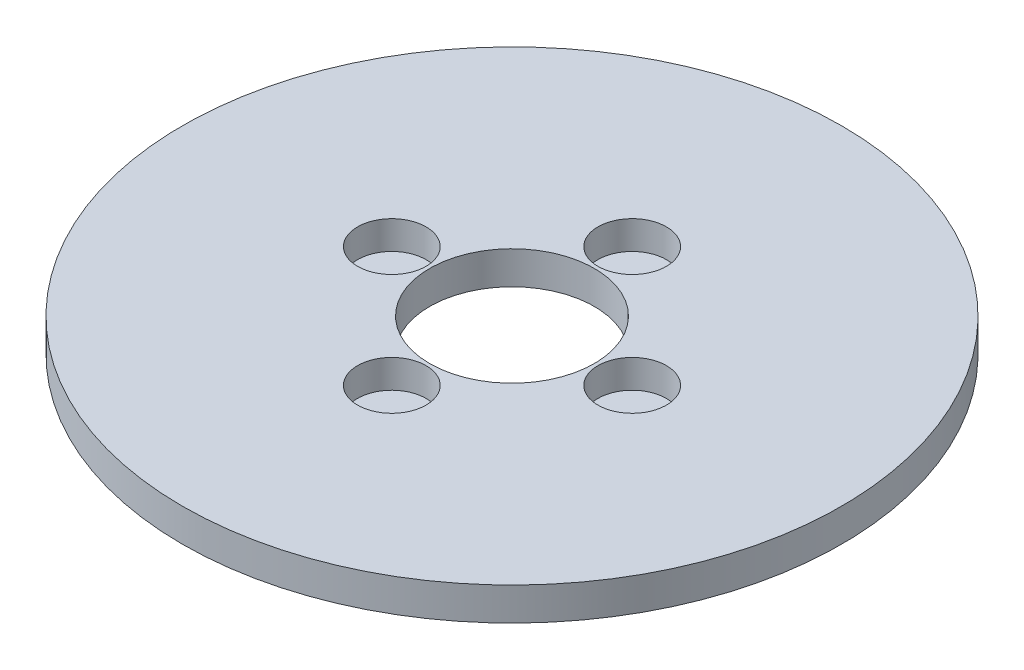
ISO-10303-21;
HEADER;
FILE_DESCRIPTION(('STEP AP214'),'2;1');
FILE_NAME('part.step','',(''),(''),'','','');
FILE_SCHEMA(('AUTOMOTIVE_DESIGN { 1 0 10303 214 1 1 1 1 }'));
ENDSEC;
DATA;
#1=APPLICATION_CONTEXT('core data for automotive mechanical design processes');
#2=APPLICATION_PROTOCOL_DEFINITION('international standard','automotive_design',2000,#1);
#3=PRODUCT_CONTEXT('',#1,'mechanical');
#4=PRODUCT('Part','Part','',(#3));
#5=PRODUCT_RELATED_PRODUCT_CATEGORY('part','',(#4));
#6=PRODUCT_DEFINITION_FORMATION('','',#4);
#7=PRODUCT_DEFINITION_CONTEXT('part definition',#1,'design');
#8=PRODUCT_DEFINITION('design','',#6,#7);
#9=PRODUCT_DEFINITION_SHAPE('','',#8);
#10=(LENGTH_UNIT() NAMED_UNIT(*) SI_UNIT(.MILLI.,.METRE.));
#11=(NAMED_UNIT(*) PLANE_ANGLE_UNIT() SI_UNIT($,.RADIAN.));
#12=(NAMED_UNIT(*) SI_UNIT($,.STERADIAN.) SOLID_ANGLE_UNIT());
#13=UNCERTAINTY_MEASURE_WITH_UNIT(LENGTH_MEASURE(1.E-05),#10,'distance_accuracy_value','');
#14=(GEOMETRIC_REPRESENTATION_CONTEXT(3) GLOBAL_UNCERTAINTY_ASSIGNED_CONTEXT((#13)) GLOBAL_UNIT_ASSIGNED_CONTEXT((#10,
#11,#12)) REPRESENTATION_CONTEXT('',''));
#15=CARTESIAN_POINT('',(0.,0.,0.));
#16=DIRECTION('',(0.,0.,1.));
#17=DIRECTION('',(1.,0.,0.));
#18=AXIS2_PLACEMENT_3D('',#15,#16,#17);
#19=CARTESIAN_POINT('',(0.,4.,0.));
#20=DIRECTION('',(0.,-1.,0.));
#21=DIRECTION('',(0.,0.,-1.));
#22=AXIS2_PLACEMENT_3D('',#19,#20,#21);
#23=CYLINDRICAL_SURFACE('',#22,40.);
#24=CARTESIAN_POINT('',(0.,4.,0.));
#25=DIRECTION('',(0.,1.,0.));
#26=DIRECTION('',(0.,0.,1.));
#27=AXIS2_PLACEMENT_3D('',#24,#25,#26);
#28=CIRCLE('',#27,40.);
#29=CARTESIAN_POINT('',(0.,4.,40.));
#30=VERTEX_POINT('',#29);
#31=EDGE_CURVE('E10',#30,#30,#28,.T.);
#32=ORIENTED_EDGE('',*,*,#31,.F.);
#33=EDGE_LOOP('',(#32));
#34=FACE_BOUND('',#33,.T.);
#35=CARTESIAN_POINT('',(0.,0.,0.));
#36=DIRECTION('',(0.,1.,0.));
#37=DIRECTION('',(0.,0.,1.));
#38=AXIS2_PLACEMENT_3D('',#35,#36,#37);
#39=CIRCLE('',#38,40.);
#40=CARTESIAN_POINT('',(0.,0.,40.));
#41=VERTEX_POINT('',#40);
#42=EDGE_CURVE('E37',#41,#41,#39,.T.);
#43=ORIENTED_EDGE('',*,*,#42,.T.);
#44=EDGE_LOOP('',(#43));
#45=FACE_BOUND('',#44,.T.);
#46=ADVANCED_FACE('F40',(#34,#45),#23,.T.);
#47=CARTESIAN_POINT('',(0.,4.,0.));
#48=DIRECTION('',(0.,1.,0.));
#49=DIRECTION('',(0.,0.,1.));
#50=AXIS2_PLACEMENT_3D('',#47,#48,#49);
#51=PLANE('',#50);
#52=CARTESIAN_POINT('',(0.,4.,14.5875206007283));
#53=DIRECTION('',(0.,1.,0.));
#54=DIRECTION('',(1.,0.,0.));
#55=AXIS2_PLACEMENT_3D('',#52,#53,#54);
#56=CIRCLE('',#55,4.15631189808937);
#57=CARTESIAN_POINT('',(4.15631189808942,4.,14.5875206007283));
#58=VERTEX_POINT('',#57);
#59=EDGE_CURVE('E71',#58,#58,#56,.T.);
#60=ORIENTED_EDGE('',*,*,#59,.F.);
#61=EDGE_LOOP('',(#60));
#62=FACE_BOUND('',#61,.T.);
#63=CARTESIAN_POINT('',(14.5875206007283,4.,0.));
#64=DIRECTION('',(0.,1.,0.));
#65=DIRECTION('',(0.,0.,-1.));
#66=AXIS2_PLACEMENT_3D('',#63,#64,#65);
#67=CIRCLE('',#66,4.15631189808937);
#68=CARTESIAN_POINT('',(14.5875206007283,4.,-4.15631189808937));
#69=VERTEX_POINT('',#68);
#70=EDGE_CURVE('E70',#69,#69,#67,.T.);
#71=ORIENTED_EDGE('',*,*,#70,.F.);
#72=EDGE_LOOP('',(#71));
#73=FACE_BOUND('',#72,.T.);
#74=CARTESIAN_POINT('',(-1.52796167872298E-13,4.,-14.5875206007283));
#75=DIRECTION('',(0.,1.,0.));
#76=DIRECTION('',(-1.,0.,0.));
#77=AXIS2_PLACEMENT_3D('',#74,#75,#76);
#78=CIRCLE('',#77,4.15631189808937);
#79=CARTESIAN_POINT('',(-4.15631189808952,4.,-14.5875206007283));
#80=VERTEX_POINT('',#79);
#81=EDGE_CURVE('E61',#80,#80,#78,.T.);
#82=ORIENTED_EDGE('',*,*,#81,.F.);
#83=EDGE_LOOP('',(#82));
#84=FACE_BOUND('',#83,.T.);
#85=CARTESIAN_POINT('',(-14.5875206007283,4.,0.));
#86=DIRECTION('',(0.,1.,0.));
#87=DIRECTION('',(0.,0.,1.));
#88=AXIS2_PLACEMENT_3D('',#85,#86,#87);
#89=CIRCLE('',#88,4.15631189808937);
#90=CARTESIAN_POINT('',(-14.5875206007283,4.,4.15631189808937));
#91=VERTEX_POINT('',#90);
#92=EDGE_CURVE('E54',#91,#91,#89,.T.);
#93=ORIENTED_EDGE('',*,*,#92,.F.);
#94=EDGE_LOOP('',(#93));
#95=FACE_BOUND('',#94,.T.);
#96=CARTESIAN_POINT('',(0.,4.,0.));
#97=DIRECTION('',(0.,1.,0.));
#98=DIRECTION('',(0.,0.,1.));
#99=AXIS2_PLACEMENT_3D('',#96,#97,#98);
#100=CIRCLE('',#99,10.);
#101=CARTESIAN_POINT('',(0.,4.,10.));
#102=VERTEX_POINT('',#101);
#103=EDGE_CURVE('E50',#102,#102,#100,.T.);
#104=ORIENTED_EDGE('',*,*,#103,.F.);
#105=EDGE_LOOP('',(#104));
#106=FACE_BOUND('',#105,.T.);
#107=ORIENTED_EDGE('',*,*,#31,.T.);
#108=EDGE_LOOP('',(#107));
#109=FACE_BOUND('',#108,.T.);
#110=ADVANCED_FACE('F86',(#62,#73,#84,#95,#106,#109),#51,.T.);
#111=CARTESIAN_POINT('',(0.,0.,0.));
#112=DIRECTION('',(0.,1.,0.));
#113=DIRECTION('',(0.,0.,1.));
#114=AXIS2_PLACEMENT_3D('',#111,#112,#113);
#115=PLANE('',#114);
#116=CARTESIAN_POINT('',(0.,0.,0.));
#117=DIRECTION('',(0.,1.,0.));
#118=DIRECTION('',(0.,0.,1.));
#119=AXIS2_PLACEMENT_3D('',#116,#117,#118);
#120=CIRCLE('',#119,10.);
#121=CARTESIAN_POINT('',(0.,0.,10.));
#122=VERTEX_POINT('',#121);
#123=EDGE_CURVE('E47',#122,#122,#120,.T.);
#124=ORIENTED_EDGE('',*,*,#123,.T.);
#125=EDGE_LOOP('',(#124));
#126=FACE_BOUND('',#125,.T.);
#127=ORIENTED_EDGE('',*,*,#42,.F.);
#128=EDGE_LOOP('',(#127));
#129=FACE_BOUND('',#128,.T.);
#130=ADVANCED_FACE('F93',(#126,#129),#115,.F.);
#131=CARTESIAN_POINT('',(0.,4.,0.));
#132=DIRECTION('',(0.,-1.,0.));
#133=DIRECTION('',(0.,0.,-1.));
#134=AXIS2_PLACEMENT_3D('',#131,#132,#133);
#135=CYLINDRICAL_SURFACE('',#134,10.);
#136=ORIENTED_EDGE('',*,*,#103,.T.);
#137=EDGE_LOOP('',(#136));
#138=FACE_BOUND('',#137,.T.);
#139=ORIENTED_EDGE('',*,*,#123,.F.);
#140=EDGE_LOOP('',(#139));
#141=FACE_BOUND('',#140,.T.);
#142=ADVANCED_FACE('F101',(#138,#141),#135,.F.);
#143=CARTESIAN_POINT('',(-14.5875206007283,0.550266280744738,0.));
#144=DIRECTION('',(0.,1.,0.));
#145=DIRECTION('',(0.,0.,1.));
#146=AXIS2_PLACEMENT_3D('',#143,#144,#145);
#147=CYLINDRICAL_SURFACE('',#146,4.15631189808937);
#148=CARTESIAN_POINT('',(-14.5875206007283,0.550266280744738,0.));
#149=DIRECTION('',(0.,1.,0.));
#150=DIRECTION('',(0.,0.,1.));
#151=AXIS2_PLACEMENT_3D('',#148,#149,#150);
#152=CIRCLE('',#151,4.15631189808937);
#153=CARTESIAN_POINT('',(-14.5875206007283,0.550266280744738,4.15631189808937));
#154=VERTEX_POINT('',#153);
#155=EDGE_CURVE('E55',#154,#154,#152,.T.);
#156=ORIENTED_EDGE('',*,*,#155,.F.);
#157=EDGE_LOOP('',(#156));
#158=FACE_BOUND('',#157,.T.);
#159=ORIENTED_EDGE('',*,*,#92,.T.);
#160=EDGE_LOOP('',(#159));
#161=FACE_BOUND('',#160,.T.);
#162=ADVANCED_FACE('F102',(#158,#161),#147,.F.);
#163=CARTESIAN_POINT('',(-14.5875206007283,0.550266280744738,0.));
#164=DIRECTION('',(0.,1.,0.));
#165=DIRECTION('',(0.,0.,1.));
#166=AXIS2_PLACEMENT_3D('',#163,#164,#165);
#167=PLANE('',#166);
#168=ORIENTED_EDGE('',*,*,#155,.T.);
#169=EDGE_LOOP('',(#168));
#170=FACE_BOUND('',#169,.T.);
#171=ADVANCED_FACE('F133',(#170),#167,.T.);
#172=CARTESIAN_POINT('',(-1.52796167872298E-13,0.550266280744738,-14.5875206007283));
#173=DIRECTION('',(0.,1.,0.));
#174=DIRECTION('',(0.,0.,1.));
#175=AXIS2_PLACEMENT_3D('',#172,#173,#174);
#176=CYLINDRICAL_SURFACE('',#175,4.15631189808937);
#177=CARTESIAN_POINT('',(-1.52796167872298E-13,0.550266280744738,-14.5875206007283));
#178=DIRECTION('',(0.,1.,0.));
#179=DIRECTION('',(-1.,0.,0.));
#180=AXIS2_PLACEMENT_3D('',#177,#178,#179);
#181=CIRCLE('',#180,4.15631189808937);
#182=CARTESIAN_POINT('',(-4.15631189808952,0.550266280744738,-14.5875206007283));
#183=VERTEX_POINT('',#182);
#184=EDGE_CURVE('E63',#183,#183,#181,.T.);
#185=ORIENTED_EDGE('',*,*,#184,.F.);
#186=EDGE_LOOP('',(#185));
#187=FACE_BOUND('',#186,.T.);
#188=ORIENTED_EDGE('',*,*,#81,.T.);
#189=EDGE_LOOP('',(#188));
#190=FACE_BOUND('',#189,.T.);
#191=ADVANCED_FACE('F142',(#187,#190),#176,.F.);
#192=CARTESIAN_POINT('',(-1.52796167872298E-13,0.550266280744738,-14.5875206007283));
#193=DIRECTION('',(0.,1.,0.));
#194=DIRECTION('',(-1.,0.,0.));
#195=AXIS2_PLACEMENT_3D('',#192,#193,#194);
#196=PLANE('',#195);
#197=ORIENTED_EDGE('',*,*,#184,.T.);
#198=EDGE_LOOP('',(#197));
#199=FACE_BOUND('',#198,.T.);
#200=ADVANCED_FACE('F156',(#199),#196,.T.);
#201=CARTESIAN_POINT('',(14.5875206007283,0.550266280744738,0.));
#202=DIRECTION('',(0.,1.,0.));
#203=DIRECTION('',(0.,0.,1.));
#204=AXIS2_PLACEMENT_3D('',#201,#202,#203);
#205=CYLINDRICAL_SURFACE('',#204,4.15631189808937);
#206=CARTESIAN_POINT('',(14.5875206007283,0.550266280744738,0.));
#207=DIRECTION('',(0.,1.,0.));
#208=DIRECTION('',(0.,0.,-1.));
#209=AXIS2_PLACEMENT_3D('',#206,#207,#208);
#210=CIRCLE('',#209,4.15631189808937);
#211=CARTESIAN_POINT('',(14.5875206007283,0.550266280744738,-4.15631189808937));
#212=VERTEX_POINT('',#211);
#213=EDGE_CURVE('E69',#212,#212,#210,.T.);
#214=ORIENTED_EDGE('',*,*,#213,.F.);
#215=EDGE_LOOP('',(#214));
#216=FACE_BOUND('',#215,.T.);
#217=ORIENTED_EDGE('',*,*,#70,.T.);
#218=EDGE_LOOP('',(#217));
#219=FACE_BOUND('',#218,.T.);
#220=ADVANCED_FACE('F164',(#216,#219),#205,.F.);
#221=CARTESIAN_POINT('',(14.5875206007283,0.550266280744738,0.));
#222=DIRECTION('',(0.,1.,0.));
#223=DIRECTION('',(0.,0.,-1.));
#224=AXIS2_PLACEMENT_3D('',#221,#222,#223);
#225=PLANE('',#224);
#226=ORIENTED_EDGE('',*,*,#213,.T.);
#227=EDGE_LOOP('',(#226));
#228=FACE_BOUND('',#227,.T.);
#229=ADVANCED_FACE('F83',(#228),#225,.T.);
#230=CARTESIAN_POINT('',(0.,0.550266280744738,14.5875206007283));
#231=DIRECTION('',(0.,1.,0.));
#232=DIRECTION('',(0.,0.,1.));
#233=AXIS2_PLACEMENT_3D('',#230,#231,#232);
#234=CYLINDRICAL_SURFACE('',#233,4.15631189808937);
#235=CARTESIAN_POINT('',(0.,0.550266280744738,14.5875206007283));
#236=DIRECTION('',(0.,1.,0.));
#237=DIRECTION('',(1.,0.,0.));
#238=AXIS2_PLACEMENT_3D('',#235,#236,#237);
#239=CIRCLE('',#238,4.15631189808937);
#240=CARTESIAN_POINT('',(4.15631189808942,0.550266280744738,14.5875206007283));
#241=VERTEX_POINT('',#240);
#242=EDGE_CURVE('E59',#241,#241,#239,.T.);
#243=ORIENTED_EDGE('',*,*,#242,.F.);
#244=EDGE_LOOP('',(#243));
#245=FACE_BOUND('',#244,.T.);
#246=ORIENTED_EDGE('',*,*,#59,.T.);
#247=EDGE_LOOP('',(#246));
#248=FACE_BOUND('',#247,.T.);
#249=ADVANCED_FACE('F81',(#245,#248),#234,.F.);
#250=CARTESIAN_POINT('',(0.,0.550266280744738,14.5875206007283));
#251=DIRECTION('',(0.,1.,0.));
#252=DIRECTION('',(1.,0.,0.));
#253=AXIS2_PLACEMENT_3D('',#250,#251,#252);
#254=PLANE('',#253);
#255=ORIENTED_EDGE('',*,*,#242,.T.);
#256=EDGE_LOOP('',(#255));
#257=FACE_BOUND('',#256,.T.);
#258=ADVANCED_FACE('F78',(#257),#254,.T.);
#259=CLOSED_SHELL('',(#46,#110,#130,#142,#162,#171,#191,#200,#220,#229,#249,#258));
#260=MANIFOLD_SOLID_BREP('B2',#259);
#261=ADVANCED_BREP_SHAPE_REPRESENTATION('',(#18,#260),#14);
#262=SHAPE_DEFINITION_REPRESENTATION(#9,#261);
ENDSEC;
END-ISO-10303-21;
